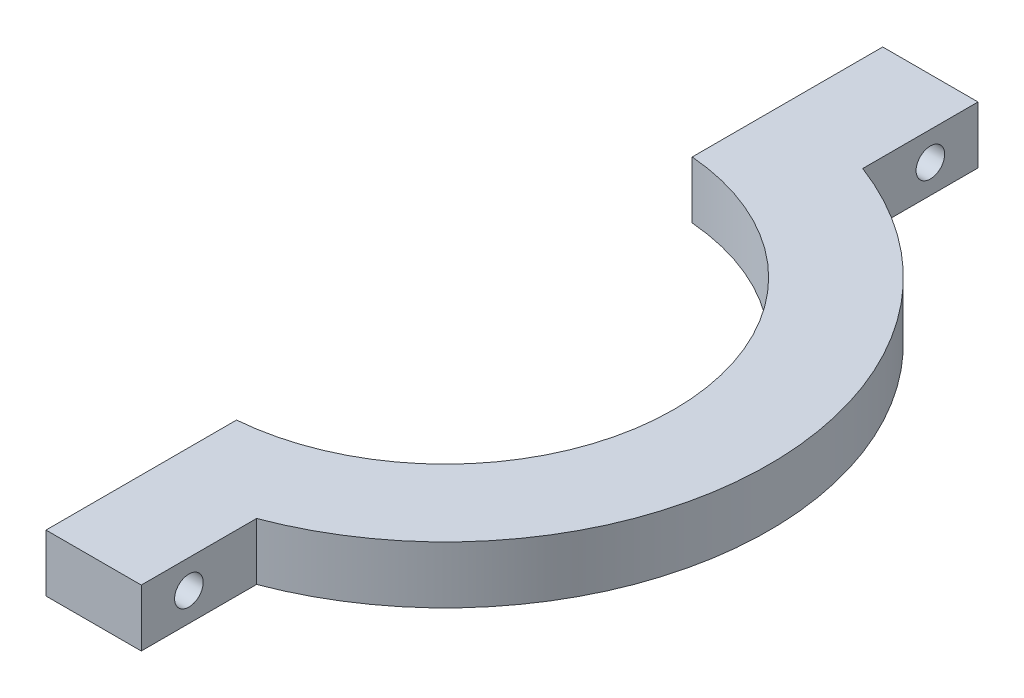
ISO-10303-21;
HEADER;
FILE_DESCRIPTION(('STEP AP214'),'2;1');
FILE_NAME('part.step','',(''),(''),'','','');
FILE_SCHEMA(('AUTOMOTIVE_DESIGN { 1 0 10303 214 1 1 1 1 }'));
ENDSEC;
DATA;
#1=APPLICATION_CONTEXT('core data for automotive mechanical design processes');
#2=APPLICATION_PROTOCOL_DEFINITION('international standard','automotive_design',2000,#1);
#3=PRODUCT_CONTEXT('',#1,'mechanical');
#4=PRODUCT('Part','Part','',(#3));
#5=PRODUCT_RELATED_PRODUCT_CATEGORY('part','',(#4));
#6=PRODUCT_DEFINITION_FORMATION('','',#4);
#7=PRODUCT_DEFINITION_CONTEXT('part definition',#1,'design');
#8=PRODUCT_DEFINITION('design','',#6,#7);
#9=PRODUCT_DEFINITION_SHAPE('','',#8);
#10=(LENGTH_UNIT() NAMED_UNIT(*) SI_UNIT(.MILLI.,.METRE.));
#11=(NAMED_UNIT(*) PLANE_ANGLE_UNIT() SI_UNIT($,.RADIAN.));
#12=(NAMED_UNIT(*) SI_UNIT($,.STERADIAN.) SOLID_ANGLE_UNIT());
#13=UNCERTAINTY_MEASURE_WITH_UNIT(LENGTH_MEASURE(1.E-05),#10,'distance_accuracy_value','');
#14=(GEOMETRIC_REPRESENTATION_CONTEXT(3) GLOBAL_UNCERTAINTY_ASSIGNED_CONTEXT((#13)) GLOBAL_UNIT_ASSIGNED_CONTEXT((#10,
#11,#12)) REPRESENTATION_CONTEXT('',''));
#15=CARTESIAN_POINT('',(0.,0.,0.));
#16=DIRECTION('',(0.,0.,1.));
#17=DIRECTION('',(1.,0.,0.));
#18=AXIS2_PLACEMENT_3D('',#15,#16,#17);
#19=CARTESIAN_POINT('',(12.,6.,43.9165214862028));
#20=DIRECTION('',(-1.,0.,0.));
#21=DIRECTION('',(0.,0.,1.));
#22=AXIS2_PLACEMENT_3D('',#19,#20,#21);
#23=PLANE('',#22);
#24=CARTESIAN_POINT('',(12.,3.,38.9165214862028));
#25=DIRECTION('',(1.,0.,0.));
#26=DIRECTION('',(0.,0.,-1.));
#27=AXIS2_PLACEMENT_3D('',#24,#25,#26);
#28=CIRCLE('',#27,1.5);
#29=CARTESIAN_POINT('',(12.,3.,37.4165214862028));
#30=VERTEX_POINT('',#29);
#31=EDGE_CURVE('E179',#30,#30,#28,.T.);
#32=ORIENTED_EDGE('',*,*,#31,.F.);
#33=EDGE_LOOP('',(#32));
#34=FACE_BOUND('',#33,.T.);
#35=DIRECTION('',(0.,0.,-1.));
#36=VECTOR('',#35,1.);
#37=CARTESIAN_POINT('',(12.,0.,43.9165214862028));
#38=LINE('',#37,#36);
#39=CARTESIAN_POINT('',(12.,0.,43.9165214862028));
#40=VERTEX_POINT('',#39);
#41=CARTESIAN_POINT('',(12.,0.,31.8119474411737));
#42=VERTEX_POINT('',#41);
#43=EDGE_CURVE('E131',#40,#42,#38,.T.);
#44=ORIENTED_EDGE('',*,*,#43,.T.);
#45=DIRECTION('',(0.,-1.,0.));
#46=VECTOR('',#45,1.);
#47=CARTESIAN_POINT('',(12.,6.,31.8119474411737));
#48=LINE('',#47,#46);
#49=CARTESIAN_POINT('',(12.,6.,31.8119474411737));
#50=VERTEX_POINT('',#49);
#51=EDGE_CURVE('E11',#50,#42,#48,.T.);
#52=ORIENTED_EDGE('',*,*,#51,.F.);
#53=DIRECTION('',(0.,0.,-1.));
#54=VECTOR('',#53,1.);
#55=CARTESIAN_POINT('',(12.,6.,43.9165214862028));
#56=LINE('',#55,#54);
#57=CARTESIAN_POINT('',(12.,6.,43.9165214862028));
#58=VERTEX_POINT('',#57);
#59=EDGE_CURVE('E146',#58,#50,#56,.T.);
#60=ORIENTED_EDGE('',*,*,#59,.F.);
#61=DIRECTION('',(0.,-1.,0.));
#62=VECTOR('',#61,1.);
#63=CARTESIAN_POINT('',(12.,6.,43.9165214862028));
#64=LINE('',#63,#62);
#65=EDGE_CURVE('E127',#58,#40,#64,.T.);
#66=ORIENTED_EDGE('',*,*,#65,.T.);
#67=EDGE_LOOP('',(#44,#52,#60,#66));
#68=FACE_BOUND('',#67,.T.);
#69=ADVANCED_FACE('F35',(#34,#68),#23,.F.);
#70=CARTESIAN_POINT('',(0.,6.,0.));
#71=DIRECTION('',(0.,-1.,0.));
#72=DIRECTION('',(0.,0.,-1.));
#73=AXIS2_PLACEMENT_3D('',#70,#71,#72);
#74=CYLINDRICAL_SURFACE('',#73,34.);
#75=CARTESIAN_POINT('',(0.,0.,0.));
#76=DIRECTION('',(0.,1.,0.));
#77=DIRECTION('',(0.,0.,1.));
#78=AXIS2_PLACEMENT_3D('',#75,#76,#77);
#79=CIRCLE('',#78,34.);
#80=CARTESIAN_POINT('',(12.,0.,-31.8119474411737));
#81=VERTEX_POINT('',#80);
#82=EDGE_CURVE('E134',#42,#81,#79,.T.);
#83=ORIENTED_EDGE('',*,*,#82,.T.);
#84=DIRECTION('',(0.,-1.,0.));
#85=VECTOR('',#84,1.);
#86=CARTESIAN_POINT('',(12.,6.,-31.8119474411737));
#87=LINE('',#86,#85);
#88=CARTESIAN_POINT('',(12.,6.,-31.8119474411737));
#89=VERTEX_POINT('',#88);
#90=EDGE_CURVE('E43',#89,#81,#87,.T.);
#91=ORIENTED_EDGE('',*,*,#90,.F.);
#92=CARTESIAN_POINT('',(0.,6.,0.));
#93=DIRECTION('',(0.,1.,0.));
#94=DIRECTION('',(0.,0.,1.));
#95=AXIS2_PLACEMENT_3D('',#92,#93,#94);
#96=CIRCLE('',#95,34.);
#97=EDGE_CURVE('E94',#50,#89,#96,.T.);
#98=ORIENTED_EDGE('',*,*,#97,.F.);
#99=ORIENTED_EDGE('',*,*,#51,.T.);
#100=EDGE_LOOP('',(#83,#91,#98,#99));
#101=FACE_BOUND('',#100,.T.);
#102=ADVANCED_FACE('F203',(#101),#74,.T.);
#103=CARTESIAN_POINT('',(12.,6.,-43.9165214862028));
#104=DIRECTION('',(-1.,0.,0.));
#105=DIRECTION('',(0.,0.,1.));
#106=AXIS2_PLACEMENT_3D('',#103,#104,#105);
#107=PLANE('',#106);
#108=CARTESIAN_POINT('',(12.,3.,-38.9165214862028));
#109=DIRECTION('',(-1.,0.,0.));
#110=DIRECTION('',(0.,0.,1.));
#111=AXIS2_PLACEMENT_3D('',#108,#109,#110);
#112=CIRCLE('',#111,1.5);
#113=CARTESIAN_POINT('',(12.,3.,-37.4165214862028));
#114=VERTEX_POINT('',#113);
#115=EDGE_CURVE('E185',#114,#114,#112,.T.);
#116=ORIENTED_EDGE('',*,*,#115,.T.);
#117=EDGE_LOOP('',(#116));
#118=FACE_BOUND('',#117,.T.);
#119=DIRECTION('',(0.,0.,-1.));
#120=VECTOR('',#119,1.);
#121=CARTESIAN_POINT('',(12.,0.,-43.9165214862028));
#122=LINE('',#121,#120);
#123=CARTESIAN_POINT('',(12.,0.,-43.9165214862028));
#124=VERTEX_POINT('',#123);
#125=EDGE_CURVE('E137',#81,#124,#122,.T.);
#126=ORIENTED_EDGE('',*,*,#125,.T.);
#127=DIRECTION('',(0.,-1.,0.));
#128=VECTOR('',#127,1.);
#129=CARTESIAN_POINT('',(12.,6.,-43.9165214862028));
#130=LINE('',#129,#128);
#131=CARTESIAN_POINT('',(12.,6.,-43.9165214862028));
#132=VERTEX_POINT('',#131);
#133=EDGE_CURVE('E153',#132,#124,#130,.T.);
#134=ORIENTED_EDGE('',*,*,#133,.F.);
#135=DIRECTION('',(0.,0.,-1.));
#136=VECTOR('',#135,1.);
#137=CARTESIAN_POINT('',(12.,6.,-43.9165214862028));
#138=LINE('',#137,#136);
#139=EDGE_CURVE('E161',#89,#132,#138,.T.);
#140=ORIENTED_EDGE('',*,*,#139,.F.);
#141=ORIENTED_EDGE('',*,*,#90,.T.);
#142=EDGE_LOOP('',(#126,#134,#140,#141));
#143=FACE_BOUND('',#142,.T.);
#144=ADVANCED_FACE('F159',(#118,#143),#107,.F.);
#145=CARTESIAN_POINT('',(1.99999999999999,6.,-43.9165214862028));
#146=DIRECTION('',(0.,0.,1.));
#147=DIRECTION('',(1.,0.,0.));
#148=AXIS2_PLACEMENT_3D('',#145,#146,#147);
#149=PLANE('',#148);
#150=DIRECTION('',(-1.,0.,0.));
#151=VECTOR('',#150,1.);
#152=CARTESIAN_POINT('',(1.99999999999999,0.,-43.9165214862028));
#153=LINE('',#152,#151);
#154=CARTESIAN_POINT('',(1.99999999999999,0.,-43.9165214862028));
#155=VERTEX_POINT('',#154);
#156=EDGE_CURVE('E139',#124,#155,#153,.T.);
#157=ORIENTED_EDGE('',*,*,#156,.T.);
#158=DIRECTION('',(0.,-1.,0.));
#159=VECTOR('',#158,1.);
#160=CARTESIAN_POINT('',(1.99999999999999,6.,-43.9165214862028));
#161=LINE('',#160,#159);
#162=CARTESIAN_POINT('',(1.99999999999999,6.,-43.9165214862028));
#163=VERTEX_POINT('',#162);
#164=EDGE_CURVE('E150',#163,#155,#161,.T.);
#165=ORIENTED_EDGE('',*,*,#164,.F.);
#166=DIRECTION('',(-1.,0.,0.));
#167=VECTOR('',#166,1.);
#168=CARTESIAN_POINT('',(1.99999999999999,6.,-43.9165214862028));
#169=LINE('',#168,#167);
#170=EDGE_CURVE('E173',#132,#163,#169,.T.);
#171=ORIENTED_EDGE('',*,*,#170,.F.);
#172=ORIENTED_EDGE('',*,*,#133,.T.);
#173=EDGE_LOOP('',(#157,#165,#171,#172));
#174=FACE_BOUND('',#173,.T.);
#175=ADVANCED_FACE('F169',(#174),#149,.F.);
#176=CARTESIAN_POINT('',(1.99999999999999,6.,-43.9165214862028));
#177=DIRECTION('',(1.,0.,0.));
#178=DIRECTION('',(0.,0.,-1.));
#179=AXIS2_PLACEMENT_3D('',#176,#177,#178);
#180=PLANE('',#179);
#181=CARTESIAN_POINT('',(1.99999999999995,3.,-38.9165214862028));
#182=DIRECTION('',(-1.,0.,0.));
#183=DIRECTION('',(0.,0.,1.));
#184=AXIS2_PLACEMENT_3D('',#181,#182,#183);
#185=CIRCLE('',#184,1.5);
#186=CARTESIAN_POINT('',(1.99999999999995,3.,-37.4165214862028));
#187=VERTEX_POINT('',#186);
#188=EDGE_CURVE('E182',#187,#187,#185,.T.);
#189=ORIENTED_EDGE('',*,*,#188,.F.);
#190=EDGE_LOOP('',(#189));
#191=FACE_BOUND('',#190,.T.);
#192=DIRECTION('',(0.,0.,1.));
#193=VECTOR('',#192,1.);
#194=CARTESIAN_POINT('',(1.99999999999999,0.,-43.9165214862028));
#195=LINE('',#194,#193);
#196=CARTESIAN_POINT('',(1.99999999999999,0.,-23.9165214862028));
#197=VERTEX_POINT('',#196);
#198=EDGE_CURVE('E141',#155,#197,#195,.T.);
#199=ORIENTED_EDGE('',*,*,#198,.T.);
#200=DIRECTION('',(0.,-1.,0.));
#201=VECTOR('',#200,1.);
#202=CARTESIAN_POINT('',(1.99999999999999,6.,-23.9165214862028));
#203=LINE('',#202,#201);
#204=CARTESIAN_POINT('',(1.99999999999999,6.,-23.9165214862028));
#205=VERTEX_POINT('',#204);
#206=EDGE_CURVE('E122',#205,#197,#203,.T.);
#207=ORIENTED_EDGE('',*,*,#206,.F.);
#208=DIRECTION('',(0.,0.,1.));
#209=VECTOR('',#208,1.);
#210=CARTESIAN_POINT('',(1.99999999999999,6.,-43.9165214862028));
#211=LINE('',#210,#209);
#212=EDGE_CURVE('E113',#163,#205,#211,.T.);
#213=ORIENTED_EDGE('',*,*,#212,.F.);
#214=ORIENTED_EDGE('',*,*,#164,.T.);
#215=EDGE_LOOP('',(#199,#207,#213,#214));
#216=FACE_BOUND('',#215,.T.);
#217=ADVANCED_FACE('F172',(#191,#216),#180,.F.);
#218=CARTESIAN_POINT('',(0.,6.,0.));
#219=DIRECTION('',(0.,-1.,0.));
#220=DIRECTION('',(0.,0.,-1.));
#221=AXIS2_PLACEMENT_3D('',#218,#219,#220);
#222=CYLINDRICAL_SURFACE('',#221,24.);
#223=CARTESIAN_POINT('',(0.,0.,0.));
#224=DIRECTION('',(0.,-1.,0.));
#225=DIRECTION('',(0.,0.,1.));
#226=AXIS2_PLACEMENT_3D('',#223,#224,#225);
#227=CIRCLE('',#226,24.);
#228=CARTESIAN_POINT('',(2.,0.,23.9165214862028));
#229=VERTEX_POINT('',#228);
#230=EDGE_CURVE('E121',#197,#229,#227,.T.);
#231=ORIENTED_EDGE('',*,*,#230,.T.);
#232=DIRECTION('',(0.,-1.,0.));
#233=VECTOR('',#232,1.);
#234=CARTESIAN_POINT('',(2.,6.,23.9165214862028));
#235=LINE('',#234,#233);
#236=CARTESIAN_POINT('',(2.,6.,23.9165214862028));
#237=VERTEX_POINT('',#236);
#238=EDGE_CURVE('E118',#237,#229,#235,.T.);
#239=ORIENTED_EDGE('',*,*,#238,.F.);
#240=CARTESIAN_POINT('',(0.,6.,0.));
#241=DIRECTION('',(0.,-1.,0.));
#242=DIRECTION('',(0.,0.,1.));
#243=AXIS2_PLACEMENT_3D('',#240,#241,#242);
#244=CIRCLE('',#243,24.);
#245=EDGE_CURVE('E107',#205,#237,#244,.T.);
#246=ORIENTED_EDGE('',*,*,#245,.F.);
#247=ORIENTED_EDGE('',*,*,#206,.T.);
#248=EDGE_LOOP('',(#231,#239,#246,#247));
#249=FACE_BOUND('',#248,.T.);
#250=ADVANCED_FACE('F119',(#249),#222,.F.);
#251=CARTESIAN_POINT('',(2.,6.,23.9165214862028));
#252=DIRECTION('',(1.,0.,0.));
#253=DIRECTION('',(0.,0.,-1.));
#254=AXIS2_PLACEMENT_3D('',#251,#252,#253);
#255=PLANE('',#254);
#256=CARTESIAN_POINT('',(1.99999999999997,3.,38.9165214862028));
#257=DIRECTION('',(1.,0.,0.));
#258=DIRECTION('',(0.,0.,-1.));
#259=AXIS2_PLACEMENT_3D('',#256,#257,#258);
#260=CIRCLE('',#259,1.5);
#261=CARTESIAN_POINT('',(1.99999999999997,3.,37.4165214862028));
#262=VERTEX_POINT('',#261);
#263=EDGE_CURVE('E135',#262,#262,#260,.T.);
#264=ORIENTED_EDGE('',*,*,#263,.T.);
#265=EDGE_LOOP('',(#264));
#266=FACE_BOUND('',#265,.T.);
#267=DIRECTION('',(0.,0.,1.));
#268=VECTOR('',#267,1.);
#269=CARTESIAN_POINT('',(2.,0.,23.9165214862028));
#270=LINE('',#269,#268);
#271=CARTESIAN_POINT('',(2.00000000000001,0.,43.9165214862028));
#272=VERTEX_POINT('',#271);
#273=EDGE_CURVE('E80',#229,#272,#270,.T.);
#274=ORIENTED_EDGE('',*,*,#273,.T.);
#275=DIRECTION('',(0.,-1.,0.));
#276=VECTOR('',#275,1.);
#277=CARTESIAN_POINT('',(2.00000000000001,6.,43.9165214862028));
#278=LINE('',#277,#276);
#279=CARTESIAN_POINT('',(2.00000000000001,6.,43.9165214862028));
#280=VERTEX_POINT('',#279);
#281=EDGE_CURVE('E123',#280,#272,#278,.T.);
#282=ORIENTED_EDGE('',*,*,#281,.F.);
#283=DIRECTION('',(0.,0.,1.));
#284=VECTOR('',#283,1.);
#285=CARTESIAN_POINT('',(2.,6.,23.9165214862028));
#286=LINE('',#285,#284);
#287=EDGE_CURVE('E111',#237,#280,#286,.T.);
#288=ORIENTED_EDGE('',*,*,#287,.F.);
#289=ORIENTED_EDGE('',*,*,#238,.T.);
#290=EDGE_LOOP('',(#274,#282,#288,#289));
#291=FACE_BOUND('',#290,.T.);
#292=ADVANCED_FACE('F125',(#266,#291),#255,.F.);
#293=CARTESIAN_POINT('',(2.00000000000001,6.,43.9165214862028));
#294=DIRECTION('',(0.,0.,-1.));
#295=DIRECTION('',(-1.,0.,0.));
#296=AXIS2_PLACEMENT_3D('',#293,#294,#295);
#297=PLANE('',#296);
#298=DIRECTION('',(1.,0.,0.));
#299=VECTOR('',#298,1.);
#300=CARTESIAN_POINT('',(2.00000000000001,0.,43.9165214862028));
#301=LINE('',#300,#299);
#302=EDGE_CURVE('E86',#272,#40,#301,.T.);
#303=ORIENTED_EDGE('',*,*,#302,.T.);
#304=ORIENTED_EDGE('',*,*,#65,.F.);
#305=DIRECTION('',(1.,0.,0.));
#306=VECTOR('',#305,1.);
#307=CARTESIAN_POINT('',(2.00000000000001,6.,43.9165214862028));
#308=LINE('',#307,#306);
#309=EDGE_CURVE('E51',#280,#58,#308,.T.);
#310=ORIENTED_EDGE('',*,*,#309,.F.);
#311=ORIENTED_EDGE('',*,*,#281,.T.);
#312=EDGE_LOOP('',(#303,#304,#310,#311));
#313=FACE_BOUND('',#312,.T.);
#314=ADVANCED_FACE('F212',(#313),#297,.F.);
#315=CARTESIAN_POINT('',(0.,6.,0.));
#316=DIRECTION('',(0.,1.,0.));
#317=DIRECTION('',(0.,0.,1.));
#318=AXIS2_PLACEMENT_3D('',#315,#316,#317);
#319=PLANE('',#318);
#320=ORIENTED_EDGE('',*,*,#59,.T.);
#321=ORIENTED_EDGE('',*,*,#97,.T.);
#322=ORIENTED_EDGE('',*,*,#139,.T.);
#323=ORIENTED_EDGE('',*,*,#170,.T.);
#324=ORIENTED_EDGE('',*,*,#212,.T.);
#325=ORIENTED_EDGE('',*,*,#245,.T.);
#326=ORIENTED_EDGE('',*,*,#287,.T.);
#327=ORIENTED_EDGE('',*,*,#309,.T.);
#328=EDGE_LOOP('',(#320,#321,#322,#323,#324,#325,#326,#327));
#329=FACE_BOUND('',#328,.T.);
#330=ADVANCED_FACE('F109',(#329),#319,.T.);
#331=CARTESIAN_POINT('',(0.,0.,0.));
#332=DIRECTION('',(0.,1.,0.));
#333=DIRECTION('',(0.,0.,1.));
#334=AXIS2_PLACEMENT_3D('',#331,#332,#333);
#335=PLANE('',#334);
#336=ORIENTED_EDGE('',*,*,#43,.F.);
#337=ORIENTED_EDGE('',*,*,#302,.F.);
#338=ORIENTED_EDGE('',*,*,#273,.F.);
#339=ORIENTED_EDGE('',*,*,#230,.F.);
#340=ORIENTED_EDGE('',*,*,#198,.F.);
#341=ORIENTED_EDGE('',*,*,#156,.F.);
#342=ORIENTED_EDGE('',*,*,#125,.F.);
#343=ORIENTED_EDGE('',*,*,#82,.F.);
#344=EDGE_LOOP('',(#336,#337,#338,#339,#340,#341,#342,#343));
#345=FACE_BOUND('',#344,.T.);
#346=ADVANCED_FACE('F165',(#345),#335,.F.);
#347=CARTESIAN_POINT('',(1.99999999999997,3.,38.9165214862028));
#348=DIRECTION('',(1.,0.,0.));
#349=DIRECTION('',(0.,0.,-1.));
#350=AXIS2_PLACEMENT_3D('',#347,#348,#349);
#351=CYLINDRICAL_SURFACE('',#350,1.5);
#352=ORIENTED_EDGE('',*,*,#263,.F.);
#353=EDGE_LOOP('',(#352));
#354=FACE_BOUND('',#353,.T.);
#355=ORIENTED_EDGE('',*,*,#31,.T.);
#356=EDGE_LOOP('',(#355));
#357=FACE_BOUND('',#356,.T.);
#358=ADVANCED_FACE('F224',(#354,#357),#351,.F.);
#359=CARTESIAN_POINT('',(1.99999999999995,3.,-38.9165214862028));
#360=DIRECTION('',(1.,0.,0.));
#361=DIRECTION('',(0.,0.,-1.));
#362=AXIS2_PLACEMENT_3D('',#359,#360,#361);
#363=CYLINDRICAL_SURFACE('',#362,1.5);
#364=ORIENTED_EDGE('',*,*,#188,.T.);
#365=EDGE_LOOP('',(#364));
#366=FACE_BOUND('',#365,.T.);
#367=ORIENTED_EDGE('',*,*,#115,.F.);
#368=EDGE_LOOP('',(#367));
#369=FACE_BOUND('',#368,.T.);
#370=ADVANCED_FACE('F191',(#366,#369),#363,.F.);
#371=CLOSED_SHELL('',(#69,#102,#144,#175,#217,#250,#292,#314,#330,#346,#358,#370));
#372=MANIFOLD_SOLID_BREP('B2',#371);
#373=ADVANCED_BREP_SHAPE_REPRESENTATION('',(#18,#372),#14);
#374=SHAPE_DEFINITION_REPRESENTATION(#9,#373);
ENDSEC;
END-ISO-10303-21;
